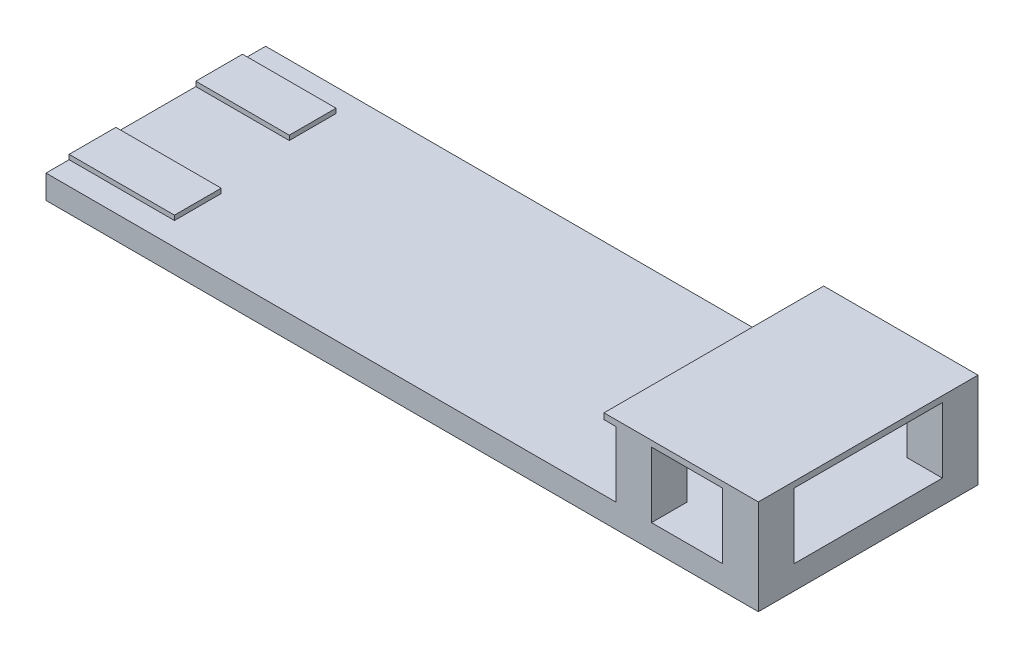
ISO-10303-21;
HEADER;
FILE_DESCRIPTION(('STEP AP214'),'2;1');
FILE_NAME('part.step','',(''),(''),'','','');
FILE_SCHEMA(('AUTOMOTIVE_DESIGN { 1 0 10303 214 1 1 1 1 }'));
ENDSEC;
DATA;
#1=APPLICATION_CONTEXT('core data for automotive mechanical design processes');
#2=APPLICATION_PROTOCOL_DEFINITION('international standard','automotive_design',2000,#1);
#3=PRODUCT_CONTEXT('',#1,'mechanical');
#4=PRODUCT('Part','Part','',(#3));
#5=PRODUCT_RELATED_PRODUCT_CATEGORY('part','',(#4));
#6=PRODUCT_DEFINITION_FORMATION('','',#4);
#7=PRODUCT_DEFINITION_CONTEXT('part definition',#1,'design');
#8=PRODUCT_DEFINITION('design','',#6,#7);
#9=PRODUCT_DEFINITION_SHAPE('','',#8);
#10=(LENGTH_UNIT() NAMED_UNIT(*) SI_UNIT(.MILLI.,.METRE.));
#11=(NAMED_UNIT(*) PLANE_ANGLE_UNIT() SI_UNIT($,.RADIAN.));
#12=(NAMED_UNIT(*) SI_UNIT($,.STERADIAN.) SOLID_ANGLE_UNIT());
#13=UNCERTAINTY_MEASURE_WITH_UNIT(LENGTH_MEASURE(1.E-05),#10,'distance_accuracy_value','');
#14=(GEOMETRIC_REPRESENTATION_CONTEXT(3) GLOBAL_UNCERTAINTY_ASSIGNED_CONTEXT((#13)) GLOBAL_UNIT_ASSIGNED_CONTEXT((#10,
#11,#12)) REPRESENTATION_CONTEXT('',''));
#15=CARTESIAN_POINT('',(0.,0.,0.));
#16=DIRECTION('',(0.,0.,1.));
#17=DIRECTION('',(1.,0.,0.));
#18=AXIS2_PLACEMENT_3D('',#15,#16,#17);
#19=CARTESIAN_POINT('',(0.,12.7,0.));
#20=DIRECTION('',(0.,1.,0.));
#21=DIRECTION('',(0.,0.,1.));
#22=AXIS2_PLACEMENT_3D('',#19,#20,#21);
#23=PLANE('',#22);
#24=DIRECTION('',(0.,0.,1.));
#25=VECTOR('',#24,1.);
#26=CARTESIAN_POINT('',(-188.1,12.7,-117.475));
#27=LINE('',#26,#25);
#28=CARTESIAN_POINT('',(-188.1,12.7,-42.75));
#29=VERTEX_POINT('',#28);
#30=CARTESIAN_POINT('',(-188.1,12.7,42.7500000000001));
#31=VERTEX_POINT('',#30);
#32=EDGE_CURVE('E234',#29,#31,#27,.T.);
#33=ORIENTED_EDGE('',*,*,#32,.T.);
#34=DIRECTION('',(-1.,0.,0.));
#35=VECTOR('',#34,1.);
#36=CARTESIAN_POINT('',(-75.4000000000001,12.7,42.7500000000001));
#37=LINE('',#36,#35);
#38=CARTESIAN_POINT('',(-75.4000000000001,12.7,42.7500000000001));
#39=VERTEX_POINT('',#38);
#40=EDGE_CURVE('E56',#39,#31,#37,.T.);
#41=ORIENTED_EDGE('',*,*,#40,.F.);
#42=DIRECTION('',(0.,0.,-1.));
#43=VECTOR('',#42,1.);
#44=CARTESIAN_POINT('',(-75.4000000000001,12.7,92.7500000000001));
#45=LINE('',#44,#43);
#46=CARTESIAN_POINT('',(-75.4000000000001,12.7,92.7500000000001));
#47=VERTEX_POINT('',#46);
#48=EDGE_CURVE('E61',#47,#39,#45,.T.);
#49=ORIENTED_EDGE('',*,*,#48,.F.);
#50=DIRECTION('',(1.,0.,0.));
#51=VECTOR('',#50,1.);
#52=CARTESIAN_POINT('',(-75.4000000000001,12.7,92.7500000000001));
#53=LINE('',#52,#51);
#54=CARTESIAN_POINT('',(-188.1,12.7,92.7500000000001));
#55=VERTEX_POINT('',#54);
#56=EDGE_CURVE('E238',#55,#47,#53,.T.);
#57=ORIENTED_EDGE('',*,*,#56,.F.);
#58=CARTESIAN_POINT('',(-188.1,12.7,117.475));
#59=VERTEX_POINT('',#58);
#60=EDGE_CURVE('E225',#55,#59,#27,.T.);
#61=ORIENTED_EDGE('',*,*,#60,.T.);
#62=DIRECTION('',(1.,0.,0.));
#63=VECTOR('',#62,1.);
#64=CARTESIAN_POINT('',(-188.1,12.7,117.475));
#65=LINE('',#64,#63);
#66=CARTESIAN_POINT('',(421.5,12.7,117.475));
#67=VERTEX_POINT('',#66);
#68=EDGE_CURVE('E429',#59,#67,#65,.T.);
#69=ORIENTED_EDGE('',*,*,#68,.T.);
#70=DIRECTION('',(0.,0.,1.));
#71=VECTOR('',#70,1.);
#72=CARTESIAN_POINT('',(421.5,12.7,117.475));
#73=LINE('',#72,#71);
#74=CARTESIAN_POINT('',(421.5,12.7,79.375));
#75=VERTEX_POINT('',#74);
#76=EDGE_CURVE('E372',#75,#67,#73,.T.);
#77=ORIENTED_EDGE('',*,*,#76,.F.);
#78=DIRECTION('',(-1.,0.,0.));
#79=VECTOR('',#78,1.);
#80=CARTESIAN_POINT('',(421.5,12.7,79.375));
#81=LINE('',#80,#79);
#82=CARTESIAN_POINT('',(459.6,12.7,79.375));
#83=VERTEX_POINT('',#82);
#84=EDGE_CURVE('E365',#83,#75,#81,.T.);
#85=ORIENTED_EDGE('',*,*,#84,.F.);
#86=DIRECTION('',(0.,0.,-1.));
#87=VECTOR('',#86,1.);
#88=CARTESIAN_POINT('',(459.6,12.7,117.475));
#89=LINE('',#88,#87);
#90=CARTESIAN_POINT('',(459.6,12.7,117.475));
#91=VERTEX_POINT('',#90);
#92=EDGE_CURVE('E368',#91,#83,#89,.T.);
#93=ORIENTED_EDGE('',*,*,#92,.F.);
#94=CARTESIAN_POINT('',(535.8,12.7,117.475));
#95=VERTEX_POINT('',#94);
#96=EDGE_CURVE('E440',#91,#95,#65,.T.);
#97=ORIENTED_EDGE('',*,*,#96,.T.);
#98=DIRECTION('',(0.,0.,1.));
#99=VECTOR('',#98,1.);
#100=CARTESIAN_POINT('',(535.8,12.7,117.475));
#101=LINE('',#100,#99);
#102=CARTESIAN_POINT('',(535.8,12.7,79.375));
#103=VERTEX_POINT('',#102);
#104=EDGE_CURVE('E392',#103,#95,#101,.T.);
#105=ORIENTED_EDGE('',*,*,#104,.F.);
#106=DIRECTION('',(-1.,0.,0.));
#107=VECTOR('',#106,1.);
#108=CARTESIAN_POINT('',(573.9,12.7,79.375));
#109=LINE('',#108,#107);
#110=CARTESIAN_POINT('',(573.9,12.7,79.375));
#111=VERTEX_POINT('',#110);
#112=EDGE_CURVE('E395',#111,#103,#109,.T.);
#113=ORIENTED_EDGE('',*,*,#112,.F.);
#114=DIRECTION('',(0.,0.,-1.));
#115=VECTOR('',#114,1.);
#116=CARTESIAN_POINT('',(573.9,12.7,-117.475));
#117=LINE('',#116,#115);
#118=CARTESIAN_POINT('',(573.9,12.7,-79.3749999999999));
#119=VERTEX_POINT('',#118);
#120=EDGE_CURVE('E424',#111,#119,#117,.T.);
#121=ORIENTED_EDGE('',*,*,#120,.T.);
#122=DIRECTION('',(1.,0.,0.));
#123=VECTOR('',#122,1.);
#124=CARTESIAN_POINT('',(573.9,12.7,-79.375));
#125=LINE('',#124,#123);
#126=CARTESIAN_POINT('',(535.8,12.7,-79.3749999999999));
#127=VERTEX_POINT('',#126);
#128=EDGE_CURVE('E408',#127,#119,#125,.T.);
#129=ORIENTED_EDGE('',*,*,#128,.F.);
#130=DIRECTION('',(0.,0.,1.));
#131=VECTOR('',#130,1.);
#132=CARTESIAN_POINT('',(535.8,12.7,-117.475));
#133=LINE('',#132,#131);
#134=CARTESIAN_POINT('',(535.8,12.7,-117.475));
#135=VERTEX_POINT('',#134);
#136=EDGE_CURVE('E399',#135,#127,#133,.T.);
#137=ORIENTED_EDGE('',*,*,#136,.F.);
#138=DIRECTION('',(-1.,0.,0.));
#139=VECTOR('',#138,1.);
#140=CARTESIAN_POINT('',(-188.1,12.7,-117.475));
#141=LINE('',#140,#139);
#142=CARTESIAN_POINT('',(459.6,12.7,-117.475));
#143=VERTEX_POINT('',#142);
#144=EDGE_CURVE('E235',#135,#143,#141,.T.);
#145=ORIENTED_EDGE('',*,*,#144,.T.);
#146=DIRECTION('',(0.,0.,-1.));
#147=VECTOR('',#146,1.);
#148=CARTESIAN_POINT('',(459.6,12.7,-117.475));
#149=LINE('',#148,#147);
#150=CARTESIAN_POINT('',(459.6,12.7,-79.3749999999999));
#151=VERTEX_POINT('',#150);
#152=EDGE_CURVE('E335',#151,#143,#149,.T.);
#153=ORIENTED_EDGE('',*,*,#152,.F.);
#154=DIRECTION('',(1.,0.,0.));
#155=VECTOR('',#154,1.);
#156=CARTESIAN_POINT('',(421.5,12.7,-79.3749999999999));
#157=LINE('',#156,#155);
#158=CARTESIAN_POINT('',(421.5,12.7,-79.3749999999999));
#159=VERTEX_POINT('',#158);
#160=EDGE_CURVE('E338',#159,#151,#157,.T.);
#161=ORIENTED_EDGE('',*,*,#160,.F.);
#162=DIRECTION('',(0.,0.,1.));
#163=VECTOR('',#162,1.);
#164=CARTESIAN_POINT('',(421.5,12.7,-117.475));
#165=LINE('',#164,#163);
#166=CARTESIAN_POINT('',(421.5,12.7,-117.475));
#167=VERTEX_POINT('',#166);
#168=EDGE_CURVE('E342',#167,#159,#165,.T.);
#169=ORIENTED_EDGE('',*,*,#168,.F.);
#170=CARTESIAN_POINT('',(-188.1,12.7,-117.475));
#171=VERTEX_POINT('',#170);
#172=EDGE_CURVE('E438',#167,#171,#141,.T.);
#173=ORIENTED_EDGE('',*,*,#172,.T.);
#174=CARTESIAN_POINT('',(-188.1,12.7,-92.7500000000001));
#175=VERTEX_POINT('',#174);
#176=EDGE_CURVE('E237',#171,#175,#27,.T.);
#177=ORIENTED_EDGE('',*,*,#176,.T.);
#178=DIRECTION('',(-1.,0.,0.));
#179=VECTOR('',#178,1.);
#180=CARTESIAN_POINT('',(-88.1000000000001,12.7,-92.7500000000001));
#181=LINE('',#180,#179);
#182=CARTESIAN_POINT('',(-88.1000000000001,12.7,-92.7500000000001));
#183=VERTEX_POINT('',#182);
#184=EDGE_CURVE('E278',#183,#175,#181,.T.);
#185=ORIENTED_EDGE('',*,*,#184,.F.);
#186=DIRECTION('',(0.,0.,-1.));
#187=VECTOR('',#186,1.);
#188=CARTESIAN_POINT('',(-88.1000000000001,12.7,-42.7500000000001));
#189=LINE('',#188,#187);
#190=CARTESIAN_POINT('',(-88.1000000000001,12.7,-42.7500000000001));
#191=VERTEX_POINT('',#190);
#192=EDGE_CURVE('E257',#191,#183,#189,.T.);
#193=ORIENTED_EDGE('',*,*,#192,.F.);
#194=DIRECTION('',(1.,0.,0.));
#195=VECTOR('',#194,1.);
#196=CARTESIAN_POINT('',(-88.1000000000001,12.7,-42.7500000000001));
#197=LINE('',#196,#195);
#198=EDGE_CURVE('E269',#29,#191,#197,.T.);
#199=ORIENTED_EDGE('',*,*,#198,.F.);
#200=EDGE_LOOP('',(#33,#41,#49,#57,#61,#69,#77,#85,#93,#97,#105,#113,#121,#129,#137,#145,#153,
#161,#169,#173,#177,#185,#193,#199));
#201=FACE_BOUND('',#200,.T.);
#202=ADVANCED_FACE('F39',(#201),#23,.T.);
#203=CARTESIAN_POINT('',(573.9,-12.7,-117.475));
#204=DIRECTION('',(1.,0.,0.));
#205=DIRECTION('',(0.,0.,-1.));
#206=AXIS2_PLACEMENT_3D('',#203,#204,#205);
#207=PLANE('',#206);
#208=DIRECTION('',(0.,1.,0.));
#209=VECTOR('',#208,1.);
#210=CARTESIAN_POINT('',(573.9,-12.7,-117.475));
#211=LINE('',#210,#209);
#212=CARTESIAN_POINT('',(573.9,-12.7,-117.475));
#213=VERTEX_POINT('',#212);
#214=CARTESIAN_POINT('',(573.9,89.05,-117.475));
#215=VERTEX_POINT('',#214);
#216=EDGE_CURVE('E43',#213,#215,#211,.T.);
#217=ORIENTED_EDGE('',*,*,#216,.T.);
#218=DIRECTION('',(0.,0.,-1.));
#219=VECTOR('',#218,1.);
#220=CARTESIAN_POINT('',(573.9,89.05,-117.475));
#221=LINE('',#220,#219);
#222=CARTESIAN_POINT('',(573.9,89.05,117.475));
#223=VERTEX_POINT('',#222);
#224=EDGE_CURVE('E295',#223,#215,#221,.T.);
#225=ORIENTED_EDGE('',*,*,#224,.F.);
#226=DIRECTION('',(0.,1.,0.));
#227=VECTOR('',#226,1.);
#228=CARTESIAN_POINT('',(573.9,-12.7,117.475));
#229=LINE('',#228,#227);
#230=CARTESIAN_POINT('',(573.9,-12.7,117.475));
#231=VERTEX_POINT('',#230);
#232=EDGE_CURVE('E11',#231,#223,#229,.T.);
#233=ORIENTED_EDGE('',*,*,#232,.F.);
#234=DIRECTION('',(0.,0.,-1.));
#235=VECTOR('',#234,1.);
#236=CARTESIAN_POINT('',(573.9,-12.7,-117.475));
#237=LINE('',#236,#235);
#238=EDGE_CURVE('E425',#231,#213,#237,.T.);
#239=ORIENTED_EDGE('',*,*,#238,.T.);
#240=EDGE_LOOP('',(#217,#225,#233,#239));
#241=FACE_BOUND('',#240,.T.);
#242=ORIENTED_EDGE('',*,*,#120,.F.);
#243=DIRECTION('',(0.,-1.,0.));
#244=VECTOR('',#243,1.);
#245=CARTESIAN_POINT('',(573.9,82.7,79.375));
#246=LINE('',#245,#244);
#247=CARTESIAN_POINT('',(573.9,82.7,79.375));
#248=VERTEX_POINT('',#247);
#249=EDGE_CURVE('E375',#248,#111,#246,.T.);
#250=ORIENTED_EDGE('',*,*,#249,.F.);
#251=DIRECTION('',(0.,0.,-1.));
#252=VECTOR('',#251,1.);
#253=CARTESIAN_POINT('',(573.9,82.7,-117.475));
#254=LINE('',#253,#252);
#255=CARTESIAN_POINT('',(573.9,82.7,-79.375));
#256=VERTEX_POINT('',#255);
#257=EDGE_CURVE('E294',#248,#256,#254,.T.);
#258=ORIENTED_EDGE('',*,*,#257,.T.);
#259=DIRECTION('',(0.,-1.,0.));
#260=VECTOR('',#259,1.);
#261=CARTESIAN_POINT('',(573.9,82.7,-79.375));
#262=LINE('',#261,#260);
#263=EDGE_CURVE('E411',#256,#119,#262,.T.);
#264=ORIENTED_EDGE('',*,*,#263,.T.);
#265=EDGE_LOOP('',(#242,#250,#258,#264));
#266=FACE_BOUND('',#265,.T.);
#267=ADVANCED_FACE('F41',(#241,#266),#207,.T.);
#268=CARTESIAN_POINT('',(-188.1,-12.7,117.475));
#269=DIRECTION('',(0.,0.,1.));
#270=DIRECTION('',(1.,0.,0.));
#271=AXIS2_PLACEMENT_3D('',#268,#269,#270);
#272=PLANE('',#271);
#273=ORIENTED_EDGE('',*,*,#232,.T.);
#274=DIRECTION('',(1.,0.,0.));
#275=VECTOR('',#274,1.);
#276=CARTESIAN_POINT('',(573.9,89.05,117.475));
#277=LINE('',#276,#275);
#278=CARTESIAN_POINT('',(408.8,89.05,117.475));
#279=VERTEX_POINT('',#278);
#280=EDGE_CURVE('E303',#279,#223,#277,.T.);
#281=ORIENTED_EDGE('',*,*,#280,.F.);
#282=DIRECTION('',(0.,-1.,0.));
#283=VECTOR('',#282,1.);
#284=CARTESIAN_POINT('',(408.8,89.05,117.475));
#285=LINE('',#284,#283);
#286=CARTESIAN_POINT('',(408.8,82.7,117.475));
#287=VERTEX_POINT('',#286);
#288=EDGE_CURVE('E306',#279,#287,#285,.T.);
#289=ORIENTED_EDGE('',*,*,#288,.T.);
#290=DIRECTION('',(1.,0.,0.));
#291=VECTOR('',#290,1.);
#292=CARTESIAN_POINT('',(573.9,82.7,117.475));
#293=LINE('',#292,#291);
#294=CARTESIAN_POINT('',(421.5,82.7,117.475));
#295=VERTEX_POINT('',#294);
#296=EDGE_CURVE('E299',#287,#295,#293,.T.);
#297=ORIENTED_EDGE('',*,*,#296,.T.);
#298=DIRECTION('',(0.,-1.,0.));
#299=VECTOR('',#298,1.);
#300=CARTESIAN_POINT('',(421.5,82.7,117.475));
#301=LINE('',#300,#299);
#302=EDGE_CURVE('E345',#295,#67,#301,.T.);
#303=ORIENTED_EDGE('',*,*,#302,.T.);
#304=ORIENTED_EDGE('',*,*,#68,.F.);
#305=DIRECTION('',(0.,1.,0.));
#306=VECTOR('',#305,1.);
#307=CARTESIAN_POINT('',(-188.1,-12.7,117.475));
#308=LINE('',#307,#306);
#309=CARTESIAN_POINT('',(-188.1,-12.7,117.475));
#310=VERTEX_POINT('',#309);
#311=EDGE_CURVE('E48',#310,#59,#308,.T.);
#312=ORIENTED_EDGE('',*,*,#311,.F.);
#313=DIRECTION('',(1.,0.,0.));
#314=VECTOR('',#313,1.);
#315=CARTESIAN_POINT('',(-188.1,-12.7,117.475));
#316=LINE('',#315,#314);
#317=EDGE_CURVE('E434',#310,#231,#316,.T.);
#318=ORIENTED_EDGE('',*,*,#317,.T.);
#319=EDGE_LOOP('',(#273,#281,#289,#297,#303,#304,#312,#318));
#320=FACE_BOUND('',#319,.T.);
#321=CARTESIAN_POINT('',(459.6,82.7,117.475));
#322=VERTEX_POINT('',#321);
#323=CARTESIAN_POINT('',(535.8,82.7,117.475));
#324=VERTEX_POINT('',#323);
#325=EDGE_CURVE('E314',#322,#324,#293,.T.);
#326=ORIENTED_EDGE('',*,*,#325,.T.);
#327=DIRECTION('',(0.,-1.,0.));
#328=VECTOR('',#327,1.);
#329=CARTESIAN_POINT('',(535.8,82.7,117.475));
#330=LINE('',#329,#328);
#331=EDGE_CURVE('E388',#324,#95,#330,.T.);
#332=ORIENTED_EDGE('',*,*,#331,.T.);
#333=ORIENTED_EDGE('',*,*,#96,.F.);
#334=DIRECTION('',(0.,-1.,0.));
#335=VECTOR('',#334,1.);
#336=CARTESIAN_POINT('',(459.6,82.7,117.475));
#337=LINE('',#336,#335);
#338=EDGE_CURVE('E355',#322,#91,#337,.T.);
#339=ORIENTED_EDGE('',*,*,#338,.F.);
#340=EDGE_LOOP('',(#326,#332,#333,#339));
#341=FACE_BOUND('',#340,.T.);
#342=ADVANCED_FACE('F459',(#320,#341),#272,.T.);
#343=CARTESIAN_POINT('',(-188.1,-12.7,-117.475));
#344=DIRECTION('',(-1.,0.,0.));
#345=DIRECTION('',(0.,0.,1.));
#346=AXIS2_PLACEMENT_3D('',#343,#344,#345);
#347=PLANE('',#346);
#348=ORIENTED_EDGE('',*,*,#176,.F.);
#349=DIRECTION('',(0.,1.,0.));
#350=VECTOR('',#349,1.);
#351=CARTESIAN_POINT('',(-188.1,-12.7,-117.475));
#352=LINE('',#351,#350);
#353=CARTESIAN_POINT('',(-188.1,-12.7,-117.475));
#354=VERTEX_POINT('',#353);
#355=EDGE_CURVE('E442',#354,#171,#352,.T.);
#356=ORIENTED_EDGE('',*,*,#355,.F.);
#357=DIRECTION('',(0.,0.,1.));
#358=VECTOR('',#357,1.);
#359=CARTESIAN_POINT('',(-188.1,-12.7,-117.475));
#360=LINE('',#359,#358);
#361=EDGE_CURVE('E432',#354,#310,#360,.T.);
#362=ORIENTED_EDGE('',*,*,#361,.T.);
#363=ORIENTED_EDGE('',*,*,#311,.T.);
#364=ORIENTED_EDGE('',*,*,#60,.F.);
#365=DIRECTION('',(0.,-1.,0.));
#366=VECTOR('',#365,1.);
#367=CARTESIAN_POINT('',(-188.1,17.7,92.7500000000001));
#368=LINE('',#367,#366);
#369=CARTESIAN_POINT('',(-188.1,17.7,92.7500000000001));
#370=VERTEX_POINT('',#369);
#371=EDGE_CURVE('E230',#370,#55,#368,.T.);
#372=ORIENTED_EDGE('',*,*,#371,.F.);
#373=DIRECTION('',(0.,0.,1.));
#374=VECTOR('',#373,1.);
#375=CARTESIAN_POINT('',(-188.1,17.7,92.7500000000001));
#376=LINE('',#375,#374);
#377=CARTESIAN_POINT('',(-188.1,17.7,42.7500000000001));
#378=VERTEX_POINT('',#377);
#379=EDGE_CURVE('E259',#378,#370,#376,.T.);
#380=ORIENTED_EDGE('',*,*,#379,.F.);
#381=DIRECTION('',(0.,-1.,0.));
#382=VECTOR('',#381,1.);
#383=CARTESIAN_POINT('',(-188.1,17.7,42.7500000000001));
#384=LINE('',#383,#382);
#385=EDGE_CURVE('E247',#378,#31,#384,.T.);
#386=ORIENTED_EDGE('',*,*,#385,.T.);
#387=ORIENTED_EDGE('',*,*,#32,.F.);
#388=DIRECTION('',(0.,-1.,0.));
#389=VECTOR('',#388,1.);
#390=CARTESIAN_POINT('',(-188.1,17.7,-42.75));
#391=LINE('',#390,#389);
#392=CARTESIAN_POINT('',(-188.1,17.7,-42.75));
#393=VERTEX_POINT('',#392);
#394=EDGE_CURVE('E285',#393,#29,#391,.T.);
#395=ORIENTED_EDGE('',*,*,#394,.F.);
#396=DIRECTION('',(0.,0.,1.));
#397=VECTOR('',#396,1.);
#398=CARTESIAN_POINT('',(-188.1,17.7,-42.75));
#399=LINE('',#398,#397);
#400=CARTESIAN_POINT('',(-188.1,17.7,-92.7500000000001));
#401=VERTEX_POINT('',#400);
#402=EDGE_CURVE('E271',#401,#393,#399,.T.);
#403=ORIENTED_EDGE('',*,*,#402,.F.);
#404=DIRECTION('',(0.,-1.,0.));
#405=VECTOR('',#404,1.);
#406=CARTESIAN_POINT('',(-188.1,17.7,-92.7500000000001));
#407=LINE('',#406,#405);
#408=EDGE_CURVE('E288',#401,#175,#407,.T.);
#409=ORIENTED_EDGE('',*,*,#408,.T.);
#410=EDGE_LOOP('',(#348,#356,#362,#363,#364,#372,#380,#386,#387,#395,#403,#409));
#411=FACE_BOUND('',#410,.T.);
#412=ADVANCED_FACE('F227',(#411),#347,.T.);
#413=CARTESIAN_POINT('',(-188.1,-12.7,-117.475));
#414=DIRECTION('',(0.,0.,-1.));
#415=DIRECTION('',(-1.,0.,0.));
#416=AXIS2_PLACEMENT_3D('',#413,#414,#415);
#417=PLANE('',#416);
#418=DIRECTION('',(0.,-1.,0.));
#419=VECTOR('',#418,1.);
#420=CARTESIAN_POINT('',(535.8,82.7,-117.475));
#421=LINE('',#420,#419);
#422=CARTESIAN_POINT('',(535.8,82.7,-117.475));
#423=VERTEX_POINT('',#422);
#424=EDGE_CURVE('E421',#423,#135,#421,.T.);
#425=ORIENTED_EDGE('',*,*,#424,.F.);
#426=DIRECTION('',(-1.,0.,0.));
#427=VECTOR('',#426,1.);
#428=CARTESIAN_POINT('',(573.9,82.7,-117.475));
#429=LINE('',#428,#427);
#430=CARTESIAN_POINT('',(459.6,82.7,-117.475));
#431=VERTEX_POINT('',#430);
#432=EDGE_CURVE('E311',#423,#431,#429,.T.);
#433=ORIENTED_EDGE('',*,*,#432,.T.);
#434=DIRECTION('',(0.,-1.,0.));
#435=VECTOR('',#434,1.);
#436=CARTESIAN_POINT('',(459.6,82.7,-117.475));
#437=LINE('',#436,#435);
#438=EDGE_CURVE('E328',#431,#143,#437,.T.);
#439=ORIENTED_EDGE('',*,*,#438,.T.);
#440=ORIENTED_EDGE('',*,*,#144,.F.);
#441=EDGE_LOOP('',(#425,#433,#439,#440));
#442=FACE_BOUND('',#441,.T.);
#443=DIRECTION('',(-1.,0.,0.));
#444=VECTOR('',#443,1.);
#445=CARTESIAN_POINT('',(573.9,89.05,-117.475));
#446=LINE('',#445,#444);
#447=CARTESIAN_POINT('',(408.8,89.05,-117.475));
#448=VERTEX_POINT('',#447);
#449=EDGE_CURVE('E298',#215,#448,#446,.T.);
#450=ORIENTED_EDGE('',*,*,#449,.F.);
#451=ORIENTED_EDGE('',*,*,#216,.F.);
#452=DIRECTION('',(-1.,0.,0.));
#453=VECTOR('',#452,1.);
#454=CARTESIAN_POINT('',(-188.1,-12.7,-117.475));
#455=LINE('',#454,#453);
#456=EDGE_CURVE('E428',#213,#354,#455,.T.);
#457=ORIENTED_EDGE('',*,*,#456,.T.);
#458=ORIENTED_EDGE('',*,*,#355,.T.);
#459=ORIENTED_EDGE('',*,*,#172,.F.);
#460=DIRECTION('',(0.,-1.,0.));
#461=VECTOR('',#460,1.);
#462=CARTESIAN_POINT('',(421.5,82.7,-117.475));
#463=LINE('',#462,#461);
#464=CARTESIAN_POINT('',(421.5,82.7,-117.475));
#465=VERTEX_POINT('',#464);
#466=EDGE_CURVE('E331',#465,#167,#463,.T.);
#467=ORIENTED_EDGE('',*,*,#466,.F.);
#468=CARTESIAN_POINT('',(408.8,82.7,-117.475));
#469=VERTEX_POINT('',#468);
#470=EDGE_CURVE('E309',#465,#469,#429,.T.);
#471=ORIENTED_EDGE('',*,*,#470,.T.);
#472=DIRECTION('',(0.,-1.,0.));
#473=VECTOR('',#472,1.);
#474=CARTESIAN_POINT('',(408.8,89.05,-117.475));
#475=LINE('',#474,#473);
#476=EDGE_CURVE('E319',#448,#469,#475,.T.);
#477=ORIENTED_EDGE('',*,*,#476,.F.);
#478=EDGE_LOOP('',(#450,#451,#457,#458,#459,#467,#471,#477));
#479=FACE_BOUND('',#478,.T.);
#480=ADVANCED_FACE('F452',(#442,#479),#417,.T.);
#481=CARTESIAN_POINT('',(0.,-12.7,0.));
#482=DIRECTION('',(0.,1.,0.));
#483=DIRECTION('',(0.,0.,1.));
#484=AXIS2_PLACEMENT_3D('',#481,#482,#483);
#485=PLANE('',#484);
#486=ORIENTED_EDGE('',*,*,#238,.F.);
#487=ORIENTED_EDGE('',*,*,#317,.F.);
#488=ORIENTED_EDGE('',*,*,#361,.F.);
#489=ORIENTED_EDGE('',*,*,#456,.F.);
#490=EDGE_LOOP('',(#486,#487,#488,#489));
#491=FACE_BOUND('',#490,.T.);
#492=ADVANCED_FACE('F464',(#491),#485,.F.);
#493=CARTESIAN_POINT('',(535.8,82.7,-117.475));
#494=DIRECTION('',(1.,0.,0.));
#495=DIRECTION('',(0.,0.,-1.));
#496=AXIS2_PLACEMENT_3D('',#493,#494,#495);
#497=PLANE('',#496);
#498=ORIENTED_EDGE('',*,*,#136,.T.);
#499=DIRECTION('',(0.,-1.,0.));
#500=VECTOR('',#499,1.);
#501=CARTESIAN_POINT('',(535.8,82.7,-79.3749999999999));
#502=LINE('',#501,#500);
#503=CARTESIAN_POINT('',(535.8,82.7,-79.3749999999999));
#504=VERTEX_POINT('',#503);
#505=EDGE_CURVE('E418',#504,#127,#502,.T.);
#506=ORIENTED_EDGE('',*,*,#505,.F.);
#507=DIRECTION('',(0.,0.,1.));
#508=VECTOR('',#507,1.);
#509=CARTESIAN_POINT('',(535.8,82.7,-117.475));
#510=LINE('',#509,#508);
#511=EDGE_CURVE('E404',#423,#504,#510,.T.);
#512=ORIENTED_EDGE('',*,*,#511,.F.);
#513=ORIENTED_EDGE('',*,*,#424,.T.);
#514=EDGE_LOOP('',(#498,#506,#512,#513));
#515=FACE_BOUND('',#514,.T.);
#516=ADVANCED_FACE('F513',(#515),#497,.F.);
#517=CARTESIAN_POINT('',(573.9,82.7,-79.375));
#518=DIRECTION('',(0.,0.,-1.));
#519=DIRECTION('',(-1.,0.,0.));
#520=AXIS2_PLACEMENT_3D('',#517,#518,#519);
#521=PLANE('',#520);
#522=ORIENTED_EDGE('',*,*,#128,.T.);
#523=ORIENTED_EDGE('',*,*,#263,.F.);
#524=DIRECTION('',(1.,0.,0.));
#525=VECTOR('',#524,1.);
#526=CARTESIAN_POINT('',(573.9,82.7,-79.375));
#527=LINE('',#526,#525);
#528=EDGE_CURVE('E407',#504,#256,#527,.T.);
#529=ORIENTED_EDGE('',*,*,#528,.F.);
#530=ORIENTED_EDGE('',*,*,#505,.T.);
#531=EDGE_LOOP('',(#522,#523,#529,#530));
#532=FACE_BOUND('',#531,.T.);
#533=ADVANCED_FACE('F565',(#532),#521,.F.);
#534=CARTESIAN_POINT('',(573.9,82.7,79.375));
#535=DIRECTION('',(0.,0.,1.));
#536=DIRECTION('',(1.,0.,0.));
#537=AXIS2_PLACEMENT_3D('',#534,#535,#536);
#538=PLANE('',#537);
#539=ORIENTED_EDGE('',*,*,#112,.T.);
#540=DIRECTION('',(0.,-1.,0.));
#541=VECTOR('',#540,1.);
#542=CARTESIAN_POINT('',(535.8,82.7,79.375));
#543=LINE('',#542,#541);
#544=CARTESIAN_POINT('',(535.8,82.7,79.375));
#545=VERTEX_POINT('',#544);
#546=EDGE_CURVE('E385',#545,#103,#543,.T.);
#547=ORIENTED_EDGE('',*,*,#546,.F.);
#548=DIRECTION('',(-1.,0.,0.));
#549=VECTOR('',#548,1.);
#550=CARTESIAN_POINT('',(573.9,82.7,79.375));
#551=LINE('',#550,#549);
#552=EDGE_CURVE('E396',#248,#545,#551,.T.);
#553=ORIENTED_EDGE('',*,*,#552,.F.);
#554=ORIENTED_EDGE('',*,*,#249,.T.);
#555=EDGE_LOOP('',(#539,#547,#553,#554));
#556=FACE_BOUND('',#555,.T.);
#557=ADVANCED_FACE('F562',(#556),#538,.F.);
#558=CARTESIAN_POINT('',(535.8,82.7,117.475));
#559=DIRECTION('',(1.,0.,0.));
#560=DIRECTION('',(0.,0.,-1.));
#561=AXIS2_PLACEMENT_3D('',#558,#559,#560);
#562=PLANE('',#561);
#563=ORIENTED_EDGE('',*,*,#104,.T.);
#564=ORIENTED_EDGE('',*,*,#331,.F.);
#565=DIRECTION('',(0.,0.,1.));
#566=VECTOR('',#565,1.);
#567=CARTESIAN_POINT('',(535.8,82.7,117.475));
#568=LINE('',#567,#566);
#569=EDGE_CURVE('E391',#545,#324,#568,.T.);
#570=ORIENTED_EDGE('',*,*,#569,.F.);
#571=ORIENTED_EDGE('',*,*,#546,.T.);
#572=EDGE_LOOP('',(#563,#564,#570,#571));
#573=FACE_BOUND('',#572,.T.);
#574=ADVANCED_FACE('F554',(#573),#562,.F.);
#575=CARTESIAN_POINT('',(421.5,82.7,117.475));
#576=DIRECTION('',(1.,0.,0.));
#577=DIRECTION('',(0.,0.,-1.));
#578=AXIS2_PLACEMENT_3D('',#575,#576,#577);
#579=PLANE('',#578);
#580=ORIENTED_EDGE('',*,*,#76,.T.);
#581=ORIENTED_EDGE('',*,*,#302,.F.);
#582=DIRECTION('',(0.,0.,1.));
#583=VECTOR('',#582,1.);
#584=CARTESIAN_POINT('',(421.5,82.7,117.475));
#585=LINE('',#584,#583);
#586=CARTESIAN_POINT('',(421.5,82.7,79.375));
#587=VERTEX_POINT('',#586);
#588=EDGE_CURVE('E369',#587,#295,#585,.T.);
#589=ORIENTED_EDGE('',*,*,#588,.F.);
#590=DIRECTION('',(0.,-1.,0.));
#591=VECTOR('',#590,1.);
#592=CARTESIAN_POINT('',(421.5,82.7,79.375));
#593=LINE('',#592,#591);
#594=EDGE_CURVE('E361',#587,#75,#593,.T.);
#595=ORIENTED_EDGE('',*,*,#594,.T.);
#596=EDGE_LOOP('',(#580,#581,#589,#595));
#597=FACE_BOUND('',#596,.T.);
#598=ADVANCED_FACE('F550',(#597),#579,.F.);
#599=CARTESIAN_POINT('',(459.6,82.7,117.475));
#600=DIRECTION('',(-1.,0.,0.));
#601=DIRECTION('',(0.,0.,1.));
#602=AXIS2_PLACEMENT_3D('',#599,#600,#601);
#603=PLANE('',#602);
#604=ORIENTED_EDGE('',*,*,#92,.T.);
#605=DIRECTION('',(0.,-1.,0.));
#606=VECTOR('',#605,1.);
#607=CARTESIAN_POINT('',(459.6,82.7,79.375));
#608=LINE('',#607,#606);
#609=CARTESIAN_POINT('',(459.6,82.7,79.375));
#610=VERTEX_POINT('',#609);
#611=EDGE_CURVE('E358',#610,#83,#608,.T.);
#612=ORIENTED_EDGE('',*,*,#611,.F.);
#613=DIRECTION('',(0.,0.,-1.));
#614=VECTOR('',#613,1.);
#615=CARTESIAN_POINT('',(459.6,82.7,117.475));
#616=LINE('',#615,#614);
#617=EDGE_CURVE('E378',#322,#610,#616,.T.);
#618=ORIENTED_EDGE('',*,*,#617,.F.);
#619=ORIENTED_EDGE('',*,*,#338,.T.);
#620=EDGE_LOOP('',(#604,#612,#618,#619));
#621=FACE_BOUND('',#620,.T.);
#622=ADVANCED_FACE('F553',(#621),#603,.F.);
#623=CARTESIAN_POINT('',(421.5,82.7,79.375));
#624=DIRECTION('',(0.,0.,1.));
#625=DIRECTION('',(1.,0.,0.));
#626=AXIS2_PLACEMENT_3D('',#623,#624,#625);
#627=PLANE('',#626);
#628=ORIENTED_EDGE('',*,*,#84,.T.);
#629=ORIENTED_EDGE('',*,*,#594,.F.);
#630=DIRECTION('',(-1.,0.,0.));
#631=VECTOR('',#630,1.);
#632=CARTESIAN_POINT('',(421.5,82.7,79.375));
#633=LINE('',#632,#631);
#634=EDGE_CURVE('E364',#610,#587,#633,.T.);
#635=ORIENTED_EDGE('',*,*,#634,.F.);
#636=ORIENTED_EDGE('',*,*,#611,.T.);
#637=EDGE_LOOP('',(#628,#629,#635,#636));
#638=FACE_BOUND('',#637,.T.);
#639=ADVANCED_FACE('F545',(#638),#627,.F.);
#640=CARTESIAN_POINT('',(421.5,82.7,-117.475));
#641=DIRECTION('',(1.,0.,0.));
#642=DIRECTION('',(0.,0.,-1.));
#643=AXIS2_PLACEMENT_3D('',#640,#641,#642);
#644=PLANE('',#643);
#645=ORIENTED_EDGE('',*,*,#168,.T.);
#646=DIRECTION('',(0.,-1.,0.));
#647=VECTOR('',#646,1.);
#648=CARTESIAN_POINT('',(421.5,82.7,-79.3749999999999));
#649=LINE('',#648,#647);
#650=CARTESIAN_POINT('',(421.5,82.7,-79.3749999999999));
#651=VERTEX_POINT('',#650);
#652=EDGE_CURVE('E322',#651,#159,#649,.T.);
#653=ORIENTED_EDGE('',*,*,#652,.F.);
#654=DIRECTION('',(0.,0.,1.));
#655=VECTOR('',#654,1.);
#656=CARTESIAN_POINT('',(421.5,82.7,-117.475));
#657=LINE('',#656,#655);
#658=EDGE_CURVE('E339',#465,#651,#657,.T.);
#659=ORIENTED_EDGE('',*,*,#658,.F.);
#660=ORIENTED_EDGE('',*,*,#466,.T.);
#661=EDGE_LOOP('',(#645,#653,#659,#660));
#662=FACE_BOUND('',#661,.T.);
#663=ADVANCED_FACE('F528',(#662),#644,.F.);
#664=CARTESIAN_POINT('',(421.5,82.7,-79.3749999999999));
#665=DIRECTION('',(0.,0.,-1.));
#666=DIRECTION('',(-1.,0.,0.));
#667=AXIS2_PLACEMENT_3D('',#664,#665,#666);
#668=PLANE('',#667);
#669=ORIENTED_EDGE('',*,*,#160,.T.);
#670=DIRECTION('',(0.,-1.,0.));
#671=VECTOR('',#670,1.);
#672=CARTESIAN_POINT('',(459.6,82.7,-79.3749999999999));
#673=LINE('',#672,#671);
#674=CARTESIAN_POINT('',(459.6,82.7,-79.3749999999999));
#675=VERTEX_POINT('',#674);
#676=EDGE_CURVE('E325',#675,#151,#673,.T.);
#677=ORIENTED_EDGE('',*,*,#676,.F.);
#678=DIRECTION('',(1.,0.,0.));
#679=VECTOR('',#678,1.);
#680=CARTESIAN_POINT('',(421.5,82.7,-79.3749999999999));
#681=LINE('',#680,#679);
#682=EDGE_CURVE('E348',#651,#675,#681,.T.);
#683=ORIENTED_EDGE('',*,*,#682,.F.);
#684=ORIENTED_EDGE('',*,*,#652,.T.);
#685=EDGE_LOOP('',(#669,#677,#683,#684));
#686=FACE_BOUND('',#685,.T.);
#687=ADVANCED_FACE('F525',(#686),#668,.F.);
#688=CARTESIAN_POINT('',(459.6,82.7,-117.475));
#689=DIRECTION('',(-1.,0.,0.));
#690=DIRECTION('',(0.,0.,1.));
#691=AXIS2_PLACEMENT_3D('',#688,#689,#690);
#692=PLANE('',#691);
#693=ORIENTED_EDGE('',*,*,#152,.T.);
#694=ORIENTED_EDGE('',*,*,#438,.F.);
#695=DIRECTION('',(0.,0.,-1.));
#696=VECTOR('',#695,1.);
#697=CARTESIAN_POINT('',(459.6,82.7,-117.475));
#698=LINE('',#697,#696);
#699=EDGE_CURVE('E334',#675,#431,#698,.T.);
#700=ORIENTED_EDGE('',*,*,#699,.F.);
#701=ORIENTED_EDGE('',*,*,#676,.T.);
#702=EDGE_LOOP('',(#693,#694,#700,#701));
#703=FACE_BOUND('',#702,.T.);
#704=ADVANCED_FACE('F523',(#703),#692,.F.);
#705=CARTESIAN_POINT('',(0.,82.7,0.));
#706=DIRECTION('',(0.,-1.,0.));
#707=DIRECTION('',(0.,0.,-1.));
#708=AXIS2_PLACEMENT_3D('',#705,#706,#707);
#709=PLANE('',#708);
#710=ORIENTED_EDGE('',*,*,#511,.T.);
#711=ORIENTED_EDGE('',*,*,#528,.T.);
#712=ORIENTED_EDGE('',*,*,#257,.F.);
#713=ORIENTED_EDGE('',*,*,#552,.T.);
#714=ORIENTED_EDGE('',*,*,#569,.T.);
#715=ORIENTED_EDGE('',*,*,#325,.F.);
#716=ORIENTED_EDGE('',*,*,#617,.T.);
#717=ORIENTED_EDGE('',*,*,#634,.T.);
#718=ORIENTED_EDGE('',*,*,#588,.T.);
#719=ORIENTED_EDGE('',*,*,#296,.F.);
#720=DIRECTION('',(0.,0.,1.));
#721=VECTOR('',#720,1.);
#722=CARTESIAN_POINT('',(408.8,82.7,-117.475));
#723=LINE('',#722,#721);
#724=EDGE_CURVE('E312',#469,#287,#723,.T.);
#725=ORIENTED_EDGE('',*,*,#724,.F.);
#726=ORIENTED_EDGE('',*,*,#470,.F.);
#727=ORIENTED_EDGE('',*,*,#658,.T.);
#728=ORIENTED_EDGE('',*,*,#682,.T.);
#729=ORIENTED_EDGE('',*,*,#699,.T.);
#730=ORIENTED_EDGE('',*,*,#432,.F.);
#731=EDGE_LOOP('',(#710,#711,#712,#713,#714,#715,#716,#717,#718,#719,#725,#726,#727,#728,#729,#730));
#732=FACE_BOUND('',#731,.T.);
#733=ADVANCED_FACE('F520',(#732),#709,.T.);
#734=CARTESIAN_POINT('',(408.8,89.05,-117.475));
#735=DIRECTION('',(1.,0.,0.));
#736=DIRECTION('',(0.,0.,-1.));
#737=AXIS2_PLACEMENT_3D('',#734,#735,#736);
#738=PLANE('',#737);
#739=ORIENTED_EDGE('',*,*,#724,.T.);
#740=ORIENTED_EDGE('',*,*,#288,.F.);
#741=DIRECTION('',(0.,0.,1.));
#742=VECTOR('',#741,1.);
#743=CARTESIAN_POINT('',(408.8,89.05,-117.475));
#744=LINE('',#743,#742);
#745=EDGE_CURVE('E301',#448,#279,#744,.T.);
#746=ORIENTED_EDGE('',*,*,#745,.F.);
#747=ORIENTED_EDGE('',*,*,#476,.T.);
#748=EDGE_LOOP('',(#739,#740,#746,#747));
#749=FACE_BOUND('',#748,.T.);
#750=ADVANCED_FACE('F533',(#749),#738,.F.);
#751=CARTESIAN_POINT('',(0.,89.05,0.));
#752=DIRECTION('',(0.,-1.,0.));
#753=DIRECTION('',(0.,0.,-1.));
#754=AXIS2_PLACEMENT_3D('',#751,#752,#753);
#755=PLANE('',#754);
#756=ORIENTED_EDGE('',*,*,#224,.T.);
#757=ORIENTED_EDGE('',*,*,#449,.T.);
#758=ORIENTED_EDGE('',*,*,#745,.T.);
#759=ORIENTED_EDGE('',*,*,#280,.T.);
#760=EDGE_LOOP('',(#756,#757,#758,#759));
#761=FACE_BOUND('',#760,.T.);
#762=ADVANCED_FACE('F455',(#761),#755,.F.);
#763=CARTESIAN_POINT('',(-88.1000000000001,17.7,-42.7500000000001));
#764=DIRECTION('',(-1.,0.,0.));
#765=DIRECTION('',(0.,0.,1.));
#766=AXIS2_PLACEMENT_3D('',#763,#764,#765);
#767=PLANE('',#766);
#768=ORIENTED_EDGE('',*,*,#192,.T.);
#769=DIRECTION('',(0.,-1.,0.));
#770=VECTOR('',#769,1.);
#771=CARTESIAN_POINT('',(-88.1000000000001,17.7,-92.7500000000001));
#772=LINE('',#771,#770);
#773=CARTESIAN_POINT('',(-88.1000000000001,17.7,-92.7500000000001));
#774=VERTEX_POINT('',#773);
#775=EDGE_CURVE('E291',#774,#183,#772,.T.);
#776=ORIENTED_EDGE('',*,*,#775,.F.);
#777=DIRECTION('',(0.,0.,-1.));
#778=VECTOR('',#777,1.);
#779=CARTESIAN_POINT('',(-88.1000000000001,17.7,-42.7500000000001));
#780=LINE('',#779,#778);
#781=CARTESIAN_POINT('',(-88.1000000000001,17.7,-42.7500000000001));
#782=VERTEX_POINT('',#781);
#783=EDGE_CURVE('E265',#782,#774,#780,.T.);
#784=ORIENTED_EDGE('',*,*,#783,.F.);
#785=DIRECTION('',(0.,-1.,0.));
#786=VECTOR('',#785,1.);
#787=CARTESIAN_POINT('',(-88.1000000000001,17.7,-42.7500000000001));
#788=LINE('',#787,#786);
#789=EDGE_CURVE('E275',#782,#191,#788,.T.);
#790=ORIENTED_EDGE('',*,*,#789,.T.);
#791=EDGE_LOOP('',(#768,#776,#784,#790));
#792=FACE_BOUND('',#791,.T.);
#793=ADVANCED_FACE('F474',(#792),#767,.F.);
#794=CARTESIAN_POINT('',(-88.1000000000001,17.7,-92.7500000000001));
#795=DIRECTION('',(0.,0.,1.));
#796=DIRECTION('',(1.,0.,0.));
#797=AXIS2_PLACEMENT_3D('',#794,#795,#796);
#798=PLANE('',#797);
#799=ORIENTED_EDGE('',*,*,#184,.T.);
#800=ORIENTED_EDGE('',*,*,#408,.F.);
#801=DIRECTION('',(-1.,0.,0.));
#802=VECTOR('',#801,1.);
#803=CARTESIAN_POINT('',(-88.1000000000001,17.7,-92.7500000000001));
#804=LINE('',#803,#802);
#805=EDGE_CURVE('E268',#774,#401,#804,.T.);
#806=ORIENTED_EDGE('',*,*,#805,.F.);
#807=ORIENTED_EDGE('',*,*,#775,.T.);
#808=EDGE_LOOP('',(#799,#800,#806,#807));
#809=FACE_BOUND('',#808,.T.);
#810=ADVANCED_FACE('F470',(#809),#798,.F.);
#811=CARTESIAN_POINT('',(-88.1000000000001,17.7,-42.7500000000001));
#812=DIRECTION('',(0.,0.,-1.));
#813=DIRECTION('',(-1.,0.,0.));
#814=AXIS2_PLACEMENT_3D('',#811,#812,#813);
#815=PLANE('',#814);
#816=ORIENTED_EDGE('',*,*,#198,.T.);
#817=ORIENTED_EDGE('',*,*,#789,.F.);
#818=DIRECTION('',(1.,0.,0.));
#819=VECTOR('',#818,1.);
#820=CARTESIAN_POINT('',(-88.1000000000001,17.7,-42.7500000000001));
#821=LINE('',#820,#819);
#822=EDGE_CURVE('E273',#393,#782,#821,.T.);
#823=ORIENTED_EDGE('',*,*,#822,.F.);
#824=ORIENTED_EDGE('',*,*,#394,.T.);
#825=EDGE_LOOP('',(#816,#817,#823,#824));
#826=FACE_BOUND('',#825,.T.);
#827=ADVANCED_FACE('F478',(#826),#815,.F.);
#828=CARTESIAN_POINT('',(0.,17.7,0.));
#829=DIRECTION('',(0.,1.,0.));
#830=DIRECTION('',(0.,0.,1.));
#831=AXIS2_PLACEMENT_3D('',#828,#829,#830);
#832=PLANE('',#831);
#833=ORIENTED_EDGE('',*,*,#783,.T.);
#834=ORIENTED_EDGE('',*,*,#805,.T.);
#835=ORIENTED_EDGE('',*,*,#402,.T.);
#836=ORIENTED_EDGE('',*,*,#822,.T.);
#837=EDGE_LOOP('',(#833,#834,#835,#836));
#838=FACE_BOUND('',#837,.T.);
#839=ADVANCED_FACE('F680',(#838),#832,.T.);
#840=CARTESIAN_POINT('',(-75.4000000000001,17.7,92.7500000000001));
#841=DIRECTION('',(-1.,0.,0.));
#842=DIRECTION('',(0.,0.,1.));
#843=AXIS2_PLACEMENT_3D('',#840,#841,#842);
#844=PLANE('',#843);
#845=ORIENTED_EDGE('',*,*,#48,.T.);
#846=DIRECTION('',(0.,-1.,0.));
#847=VECTOR('',#846,1.);
#848=CARTESIAN_POINT('',(-75.4000000000001,17.7,42.7500000000001));
#849=LINE('',#848,#847);
#850=CARTESIAN_POINT('',(-75.4000000000001,17.7,42.7500000000001));
#851=VERTEX_POINT('',#850);
#852=EDGE_CURVE('E251',#851,#39,#849,.T.);
#853=ORIENTED_EDGE('',*,*,#852,.F.);
#854=DIRECTION('',(0.,0.,-1.));
#855=VECTOR('',#854,1.);
#856=CARTESIAN_POINT('',(-75.4000000000001,17.7,92.7500000000001));
#857=LINE('',#856,#855);
#858=CARTESIAN_POINT('',(-75.4000000000001,17.7,92.7500000000001));
#859=VERTEX_POINT('',#858);
#860=EDGE_CURVE('E242',#859,#851,#857,.T.);
#861=ORIENTED_EDGE('',*,*,#860,.F.);
#862=DIRECTION('',(0.,-1.,0.));
#863=VECTOR('',#862,1.);
#864=CARTESIAN_POINT('',(-75.4000000000001,17.7,92.7500000000001));
#865=LINE('',#864,#863);
#866=EDGE_CURVE('E246',#859,#47,#865,.T.);
#867=ORIENTED_EDGE('',*,*,#866,.T.);
#868=EDGE_LOOP('',(#845,#853,#861,#867));
#869=FACE_BOUND('',#868,.T.);
#870=ADVANCED_FACE('F487',(#869),#844,.F.);
#871=CARTESIAN_POINT('',(-75.4000000000001,17.7,42.7500000000001));
#872=DIRECTION('',(0.,0.,1.));
#873=DIRECTION('',(1.,0.,0.));
#874=AXIS2_PLACEMENT_3D('',#871,#872,#873);
#875=PLANE('',#874);
#876=ORIENTED_EDGE('',*,*,#40,.T.);
#877=ORIENTED_EDGE('',*,*,#385,.F.);
#878=DIRECTION('',(-1.,0.,0.));
#879=VECTOR('',#878,1.);
#880=CARTESIAN_POINT('',(-75.4000000000001,17.7,42.7500000000001));
#881=LINE('',#880,#879);
#882=EDGE_CURVE('E261',#851,#378,#881,.T.);
#883=ORIENTED_EDGE('',*,*,#882,.F.);
#884=ORIENTED_EDGE('',*,*,#852,.T.);
#885=EDGE_LOOP('',(#876,#877,#883,#884));
#886=FACE_BOUND('',#885,.T.);
#887=ADVANCED_FACE('F483',(#886),#875,.F.);
#888=CARTESIAN_POINT('',(-75.4000000000001,17.7,92.7500000000001));
#889=DIRECTION('',(0.,0.,-1.));
#890=DIRECTION('',(-1.,0.,0.));
#891=AXIS2_PLACEMENT_3D('',#888,#889,#890);
#892=PLANE('',#891);
#893=ORIENTED_EDGE('',*,*,#56,.T.);
#894=ORIENTED_EDGE('',*,*,#866,.F.);
#895=DIRECTION('',(1.,0.,0.));
#896=VECTOR('',#895,1.);
#897=CARTESIAN_POINT('',(-75.4000000000001,17.7,92.7500000000001));
#898=LINE('',#897,#896);
#899=EDGE_CURVE('E245',#370,#859,#898,.T.);
#900=ORIENTED_EDGE('',*,*,#899,.F.);
#901=ORIENTED_EDGE('',*,*,#371,.T.);
#902=EDGE_LOOP('',(#893,#894,#900,#901));
#903=FACE_BOUND('',#902,.T.);
#904=ADVANCED_FACE('F244',(#903),#892,.F.);
#905=CARTESIAN_POINT('',(0.,17.7,0.));
#906=DIRECTION('',(0.,1.,0.));
#907=DIRECTION('',(0.,0.,1.));
#908=AXIS2_PLACEMENT_3D('',#905,#906,#907);
#909=PLANE('',#908);
#910=ORIENTED_EDGE('',*,*,#860,.T.);
#911=ORIENTED_EDGE('',*,*,#882,.T.);
#912=ORIENTED_EDGE('',*,*,#379,.T.);
#913=ORIENTED_EDGE('',*,*,#899,.T.);
#914=EDGE_LOOP('',(#910,#911,#912,#913));
#915=FACE_BOUND('',#914,.T.);
#916=ADVANCED_FACE('F489',(#915),#909,.T.);
#917=CLOSED_SHELL('',(#202,#267,#342,#412,#480,#492,#516,#533,#557,#574,#598,#622,#639,#663,
#687,#704,#733,#750,#762,#793,#810,#827,#839,#870,#887,#904,#916));
#918=MANIFOLD_SOLID_BREP('B2',#917);
#919=ADVANCED_BREP_SHAPE_REPRESENTATION('',(#18,#918),#14);
#920=SHAPE_DEFINITION_REPRESENTATION(#9,#919);
ENDSEC;
END-ISO-10303-21;
